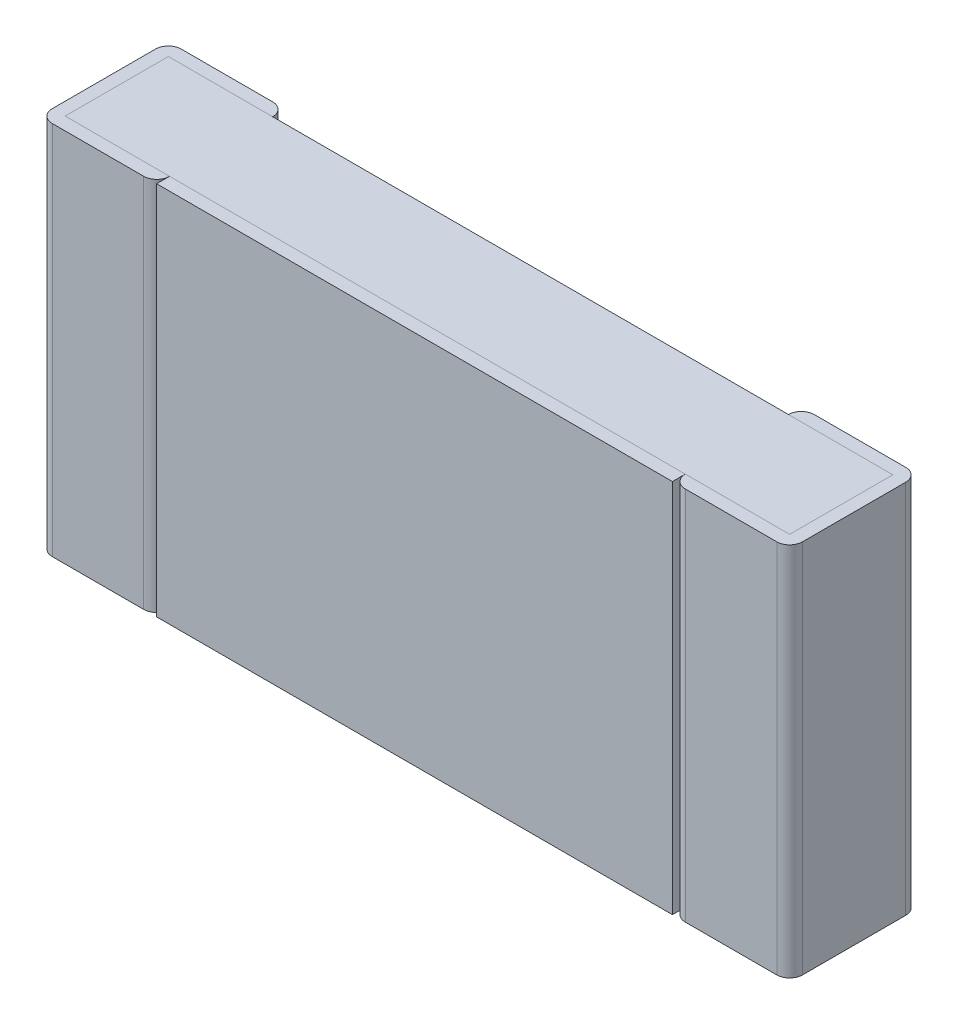
ISO-10303-21;
HEADER;
FILE_DESCRIPTION(('STEP AP214'),'2;1');
FILE_NAME('part.step','',(''),(''),'','','');
FILE_SCHEMA(('AUTOMOTIVE_DESIGN { 1 0 10303 214 1 1 1 1 }'));
ENDSEC;
DATA;
#1=APPLICATION_CONTEXT('core data for automotive mechanical design processes');
#2=APPLICATION_PROTOCOL_DEFINITION('international standard','automotive_design',2000,#1);
#3=PRODUCT_CONTEXT('',#1,'mechanical');
#4=PRODUCT('Part','Part','',(#3));
#5=PRODUCT_RELATED_PRODUCT_CATEGORY('part','',(#4));
#6=PRODUCT_DEFINITION_FORMATION('','',#4);
#7=PRODUCT_DEFINITION_CONTEXT('part definition',#1,'design');
#8=PRODUCT_DEFINITION('design','',#6,#7);
#9=PRODUCT_DEFINITION_SHAPE('','',#8);
#10=(LENGTH_UNIT() NAMED_UNIT(*) SI_UNIT(.MILLI.,.METRE.));
#11=(NAMED_UNIT(*) PLANE_ANGLE_UNIT() SI_UNIT($,.RADIAN.));
#12=(NAMED_UNIT(*) SI_UNIT($,.STERADIAN.) SOLID_ANGLE_UNIT());
#13=UNCERTAINTY_MEASURE_WITH_UNIT(LENGTH_MEASURE(1.E-05),#10,'distance_accuracy_value','');
#14=(GEOMETRIC_REPRESENTATION_CONTEXT(3) GLOBAL_UNCERTAINTY_ASSIGNED_CONTEXT((#13)) GLOBAL_UNIT_ASSIGNED_CONTEXT((#10,
#11,#12)) REPRESENTATION_CONTEXT('',''));
#15=CARTESIAN_POINT('',(0.,0.,0.));
#16=DIRECTION('',(0.,0.,1.));
#17=DIRECTION('',(1.,0.,0.));
#18=AXIS2_PLACEMENT_3D('',#15,#16,#17);
#19=CARTESIAN_POINT('',(-1.1,-0.8,0.55));
#20=DIRECTION('',(0.,0.,1.));
#21=DIRECTION('',(1.,0.,0.));
#22=AXIS2_PLACEMENT_3D('',#19,#20,#21);
#23=PLANE('',#22);
#24=DIRECTION('',(0.,1.,0.));
#25=VECTOR('',#24,1.);
#26=CARTESIAN_POINT('',(-1.1,-0.8,0.55));
#27=LINE('',#26,#25);
#28=CARTESIAN_POINT('',(-1.1,-0.8,0.55));
#29=VERTEX_POINT('',#28);
#30=CARTESIAN_POINT('',(-1.1,0.8,0.55));
#31=VERTEX_POINT('',#30);
#32=EDGE_CURVE('E253',#29,#31,#27,.T.);
#33=ORIENTED_EDGE('',*,*,#32,.F.);
#34=DIRECTION('',(1.,0.,0.));
#35=VECTOR('',#34,1.);
#36=CARTESIAN_POINT('',(-1.1,-0.8,0.55));
#37=LINE('',#36,#35);
#38=CARTESIAN_POINT('',(1.1,-0.8,0.55));
#39=VERTEX_POINT('',#38);
#40=EDGE_CURVE('E347',#29,#39,#37,.T.);
#41=ORIENTED_EDGE('',*,*,#40,.T.);
#42=DIRECTION('',(0.,1.,0.));
#43=VECTOR('',#42,1.);
#44=CARTESIAN_POINT('',(1.1,-0.8,0.55));
#45=LINE('',#44,#43);
#46=CARTESIAN_POINT('',(1.1,0.8,0.55));
#47=VERTEX_POINT('',#46);
#48=EDGE_CURVE('E11',#39,#47,#45,.T.);
#49=ORIENTED_EDGE('',*,*,#48,.T.);
#50=DIRECTION('',(1.,0.,0.));
#51=VECTOR('',#50,1.);
#52=CARTESIAN_POINT('',(-1.1,0.8,0.55));
#53=LINE('',#52,#51);
#54=EDGE_CURVE('E267',#31,#47,#53,.T.);
#55=ORIENTED_EDGE('',*,*,#54,.F.);
#56=EDGE_LOOP('',(#33,#41,#49,#55));
#57=FACE_BOUND('',#56,.T.);
#58=ADVANCED_FACE('F17',(#57),#23,.T.);
#59=CARTESIAN_POINT('',(1.1,-0.8,0.495));
#60=DIRECTION('',(1.,0.,0.));
#61=DIRECTION('',(0.,1.,0.));
#62=AXIS2_PLACEMENT_3D('',#59,#60,#61);
#63=PLANE('',#62);
#64=DIRECTION('',(0.,0.,1.));
#65=VECTOR('',#64,1.);
#66=CARTESIAN_POINT('',(1.1,-0.8,0.495));
#67=LINE('',#66,#65);
#68=CARTESIAN_POINT('',(1.1,-0.8,0.495));
#69=VERTEX_POINT('',#68);
#70=EDGE_CURVE('E392',#69,#39,#67,.T.);
#71=ORIENTED_EDGE('',*,*,#70,.F.);
#72=DIRECTION('',(0.,1.,0.));
#73=VECTOR('',#72,1.);
#74=CARTESIAN_POINT('',(1.1,-0.8,0.495));
#75=LINE('',#74,#73);
#76=CARTESIAN_POINT('',(1.1,0.8,0.495));
#77=VERTEX_POINT('',#76);
#78=EDGE_CURVE('E28',#69,#77,#75,.T.);
#79=ORIENTED_EDGE('',*,*,#78,.T.);
#80=DIRECTION('',(0.,0.,1.));
#81=VECTOR('',#80,1.);
#82=CARTESIAN_POINT('',(1.1,0.8,0.495));
#83=LINE('',#82,#81);
#84=EDGE_CURVE('E262',#77,#47,#83,.T.);
#85=ORIENTED_EDGE('',*,*,#84,.T.);
#86=ORIENTED_EDGE('',*,*,#48,.F.);
#87=EDGE_LOOP('',(#71,#79,#85,#86));
#88=FACE_BOUND('',#87,.T.);
#89=ADVANCED_FACE('F517',(#88),#63,.T.);
#90=CARTESIAN_POINT('',(1.155,-0.8,0.495));
#91=DIRECTION('',(0.,1.,0.));
#92=DIRECTION('',(-1.,0.,0.));
#93=AXIS2_PLACEMENT_3D('',#90,#91,#92);
#94=CYLINDRICAL_SURFACE('',#93,0.055);
#95=CARTESIAN_POINT('',(1.155,-0.8,0.495));
#96=DIRECTION('',(0.,1.,0.));
#97=DIRECTION('',(0.,0.,1.));
#98=AXIS2_PLACEMENT_3D('',#95,#96,#97);
#99=CIRCLE('',#98,0.055);
#100=CARTESIAN_POINT('',(1.155,-0.8,0.55));
#101=VERTEX_POINT('',#100);
#102=EDGE_CURVE('E339',#69,#101,#99,.T.);
#103=ORIENTED_EDGE('',*,*,#102,.T.);
#104=DIRECTION('',(0.,1.,0.));
#105=VECTOR('',#104,1.);
#106=CARTESIAN_POINT('',(1.155,-0.8,0.55));
#107=LINE('',#106,#105);
#108=CARTESIAN_POINT('',(1.155,0.8,0.55));
#109=VERTEX_POINT('',#108);
#110=EDGE_CURVE('E452',#101,#109,#107,.T.);
#111=ORIENTED_EDGE('',*,*,#110,.T.);
#112=CARTESIAN_POINT('',(1.155,0.8,0.495));
#113=DIRECTION('',(0.,1.,0.));
#114=DIRECTION('',(0.,0.,1.));
#115=AXIS2_PLACEMENT_3D('',#112,#113,#114);
#116=CIRCLE('',#115,0.055);
#117=EDGE_CURVE('E313',#77,#109,#116,.T.);
#118=ORIENTED_EDGE('',*,*,#117,.F.);
#119=ORIENTED_EDGE('',*,*,#78,.F.);
#120=EDGE_LOOP('',(#103,#111,#118,#119));
#121=FACE_BOUND('',#120,.T.);
#122=ADVANCED_FACE('F530',(#121),#94,.T.);
#123=CARTESIAN_POINT('',(1.1,-0.8,0.55));
#124=DIRECTION('',(0.,0.,1.));
#125=DIRECTION('',(1.,0.,0.));
#126=AXIS2_PLACEMENT_3D('',#123,#124,#125);
#127=PLANE('',#126);
#128=DIRECTION('',(1.,0.,0.));
#129=VECTOR('',#128,1.);
#130=CARTESIAN_POINT('',(1.1,0.8,0.55));
#131=LINE('',#130,#129);
#132=CARTESIAN_POINT('',(1.545,0.8,0.55));
#133=VERTEX_POINT('',#132);
#134=EDGE_CURVE('E320',#109,#133,#131,.T.);
#135=ORIENTED_EDGE('',*,*,#134,.F.);
#136=ORIENTED_EDGE('',*,*,#110,.F.);
#137=DIRECTION('',(1.,0.,0.));
#138=VECTOR('',#137,1.);
#139=CARTESIAN_POINT('',(1.1,-0.8,0.55));
#140=LINE('',#139,#138);
#141=CARTESIAN_POINT('',(1.545,-0.8,0.55));
#142=VERTEX_POINT('',#141);
#143=EDGE_CURVE('E21',#101,#142,#140,.T.);
#144=ORIENTED_EDGE('',*,*,#143,.T.);
#145=DIRECTION('',(0.,1.,0.));
#146=VECTOR('',#145,1.);
#147=CARTESIAN_POINT('',(1.545,-0.8,0.55));
#148=LINE('',#147,#146);
#149=EDGE_CURVE('E286',#142,#133,#148,.T.);
#150=ORIENTED_EDGE('',*,*,#149,.T.);
#151=EDGE_LOOP('',(#135,#136,#144,#150));
#152=FACE_BOUND('',#151,.T.);
#153=ADVANCED_FACE('F712',(#152),#127,.T.);
#154=CARTESIAN_POINT('',(1.545,-0.8,0.495));
#155=DIRECTION('',(0.,1.,0.));
#156=DIRECTION('',(1.,0.,0.));
#157=AXIS2_PLACEMENT_3D('',#154,#155,#156);
#158=CYLINDRICAL_SURFACE('',#157,0.055);
#159=DIRECTION('',(0.,1.,0.));
#160=VECTOR('',#159,1.);
#161=CARTESIAN_POINT('',(1.6,-0.8,0.495));
#162=LINE('',#161,#160);
#163=CARTESIAN_POINT('',(1.6,-0.8,0.495));
#164=VERTEX_POINT('',#163);
#165=CARTESIAN_POINT('',(1.6,0.8,0.495));
#166=VERTEX_POINT('',#165);
#167=EDGE_CURVE('E283',#164,#166,#162,.T.);
#168=ORIENTED_EDGE('',*,*,#167,.T.);
#169=CARTESIAN_POINT('',(1.545,0.8,0.495));
#170=DIRECTION('',(0.,-1.,0.));
#171=DIRECTION('',(0.,0.,1.));
#172=AXIS2_PLACEMENT_3D('',#169,#170,#171);
#173=CIRCLE('',#172,0.055);
#174=EDGE_CURVE('E328',#166,#133,#173,.T.);
#175=ORIENTED_EDGE('',*,*,#174,.T.);
#176=ORIENTED_EDGE('',*,*,#149,.F.);
#177=CARTESIAN_POINT('',(1.545,-0.8,0.495));
#178=DIRECTION('',(0.,-1.,0.));
#179=DIRECTION('',(0.,0.,1.));
#180=AXIS2_PLACEMENT_3D('',#177,#178,#179);
#181=CIRCLE('',#180,0.055);
#182=EDGE_CURVE('E353',#164,#142,#181,.T.);
#183=ORIENTED_EDGE('',*,*,#182,.F.);
#184=EDGE_LOOP('',(#168,#175,#176,#183));
#185=FACE_BOUND('',#184,.T.);
#186=ADVANCED_FACE('F707',(#185),#158,.T.);
#187=CARTESIAN_POINT('',(1.6,-0.8,0.));
#188=DIRECTION('',(1.,0.,0.));
#189=DIRECTION('',(0.,1.,0.));
#190=AXIS2_PLACEMENT_3D('',#187,#188,#189);
#191=PLANE('',#190);
#192=DIRECTION('',(0.,0.,1.));
#193=VECTOR('',#192,1.);
#194=CARTESIAN_POINT('',(1.6,-0.8,0.));
#195=LINE('',#194,#193);
#196=CARTESIAN_POINT('',(1.6,-0.8,0.055));
#197=VERTEX_POINT('',#196);
#198=EDGE_CURVE('E357',#197,#164,#195,.T.);
#199=ORIENTED_EDGE('',*,*,#198,.F.);
#200=DIRECTION('',(0.,1.,0.));
#201=VECTOR('',#200,1.);
#202=CARTESIAN_POINT('',(1.6,-0.8,0.055));
#203=LINE('',#202,#201);
#204=CARTESIAN_POINT('',(1.6,0.8,0.055));
#205=VERTEX_POINT('',#204);
#206=EDGE_CURVE('E287',#197,#205,#203,.T.);
#207=ORIENTED_EDGE('',*,*,#206,.T.);
#208=DIRECTION('',(0.,0.,1.));
#209=VECTOR('',#208,1.);
#210=CARTESIAN_POINT('',(1.6,0.8,0.));
#211=LINE('',#210,#209);
#212=EDGE_CURVE('E247',#205,#166,#211,.T.);
#213=ORIENTED_EDGE('',*,*,#212,.T.);
#214=ORIENTED_EDGE('',*,*,#167,.F.);
#215=EDGE_LOOP('',(#199,#207,#213,#214));
#216=FACE_BOUND('',#215,.T.);
#217=ADVANCED_FACE('F711',(#216),#191,.T.);
#218=CARTESIAN_POINT('',(1.545,-0.8,0.055));
#219=DIRECTION('',(0.,1.,0.));
#220=DIRECTION('',(1.,0.,0.));
#221=AXIS2_PLACEMENT_3D('',#218,#219,#220);
#222=CYLINDRICAL_SURFACE('',#221,0.055);
#223=CARTESIAN_POINT('',(1.545,-0.8,0.055));
#224=DIRECTION('',(0.,1.,0.));
#225=DIRECTION('',(0.,0.,1.));
#226=AXIS2_PLACEMENT_3D('',#223,#224,#225);
#227=CIRCLE('',#226,0.055);
#228=CARTESIAN_POINT('',(1.545,-0.8,0.));
#229=VERTEX_POINT('',#228);
#230=EDGE_CURVE('E368',#197,#229,#227,.T.);
#231=ORIENTED_EDGE('',*,*,#230,.T.);
#232=DIRECTION('',(0.,1.,0.));
#233=VECTOR('',#232,1.);
#234=CARTESIAN_POINT('',(1.545,-0.8,0.));
#235=LINE('',#234,#233);
#236=CARTESIAN_POINT('',(1.545,0.8,0.));
#237=VERTEX_POINT('',#236);
#238=EDGE_CURVE('E261',#229,#237,#235,.T.);
#239=ORIENTED_EDGE('',*,*,#238,.T.);
#240=CARTESIAN_POINT('',(1.545,0.8,0.055));
#241=DIRECTION('',(0.,1.,0.));
#242=DIRECTION('',(0.,0.,1.));
#243=AXIS2_PLACEMENT_3D('',#240,#241,#242);
#244=CIRCLE('',#243,0.055);
#245=EDGE_CURVE('E263',#205,#237,#244,.T.);
#246=ORIENTED_EDGE('',*,*,#245,.F.);
#247=ORIENTED_EDGE('',*,*,#206,.F.);
#248=EDGE_LOOP('',(#231,#239,#246,#247));
#249=FACE_BOUND('',#248,.T.);
#250=ADVANCED_FACE('F464',(#249),#222,.T.);
#251=CARTESIAN_POINT('',(1.1,-0.8,0.));
#252=DIRECTION('',(0.,0.,1.));
#253=DIRECTION('',(1.,0.,0.));
#254=AXIS2_PLACEMENT_3D('',#251,#252,#253);
#255=PLANE('',#254);
#256=ORIENTED_EDGE('',*,*,#238,.F.);
#257=DIRECTION('',(1.,0.,0.));
#258=VECTOR('',#257,1.);
#259=CARTESIAN_POINT('',(1.1,-0.8,0.));
#260=LINE('',#259,#258);
#261=CARTESIAN_POINT('',(1.155,-0.8,0.));
#262=VERTEX_POINT('',#261);
#263=EDGE_CURVE('E396',#262,#229,#260,.T.);
#264=ORIENTED_EDGE('',*,*,#263,.F.);
#265=DIRECTION('',(0.,1.,0.));
#266=VECTOR('',#265,1.);
#267=CARTESIAN_POINT('',(1.155,-0.8,0.));
#268=LINE('',#267,#266);
#269=CARTESIAN_POINT('',(1.155,0.8,0.));
#270=VERTEX_POINT('',#269);
#271=EDGE_CURVE('E258',#262,#270,#268,.T.);
#272=ORIENTED_EDGE('',*,*,#271,.T.);
#273=DIRECTION('',(1.,0.,0.));
#274=VECTOR('',#273,1.);
#275=CARTESIAN_POINT('',(1.1,0.8,0.));
#276=LINE('',#275,#274);
#277=EDGE_CURVE('E252',#270,#237,#276,.T.);
#278=ORIENTED_EDGE('',*,*,#277,.T.);
#279=EDGE_LOOP('',(#256,#264,#272,#278));
#280=FACE_BOUND('',#279,.T.);
#281=ADVANCED_FACE('F470',(#280),#255,.F.);
#282=CARTESIAN_POINT('',(1.155,-0.8,0.055));
#283=DIRECTION('',(0.,1.,0.));
#284=DIRECTION('',(-1.,0.,0.));
#285=AXIS2_PLACEMENT_3D('',#282,#283,#284);
#286=CYLINDRICAL_SURFACE('',#285,0.055);
#287=DIRECTION('',(0.,1.,0.));
#288=VECTOR('',#287,1.);
#289=CARTESIAN_POINT('',(1.1,-0.8,0.055));
#290=LINE('',#289,#288);
#291=CARTESIAN_POINT('',(1.1,-0.8,0.055));
#292=VERTEX_POINT('',#291);
#293=CARTESIAN_POINT('',(1.1,0.8,0.055));
#294=VERTEX_POINT('',#293);
#295=EDGE_CURVE('E375',#292,#294,#290,.T.);
#296=ORIENTED_EDGE('',*,*,#295,.T.);
#297=CARTESIAN_POINT('',(1.155,0.8,0.055));
#298=DIRECTION('',(0.,-1.,0.));
#299=DIRECTION('',(0.,0.,1.));
#300=AXIS2_PLACEMENT_3D('',#297,#298,#299);
#301=CIRCLE('',#300,0.055);
#302=EDGE_CURVE('E299',#294,#270,#301,.T.);
#303=ORIENTED_EDGE('',*,*,#302,.T.);
#304=ORIENTED_EDGE('',*,*,#271,.F.);
#305=CARTESIAN_POINT('',(1.155,-0.8,0.055));
#306=DIRECTION('',(0.,-1.,0.));
#307=DIRECTION('',(0.,0.,1.));
#308=AXIS2_PLACEMENT_3D('',#305,#306,#307);
#309=CIRCLE('',#308,0.055);
#310=EDGE_CURVE('E343',#292,#262,#309,.T.);
#311=ORIENTED_EDGE('',*,*,#310,.F.);
#312=EDGE_LOOP('',(#296,#303,#304,#311));
#313=FACE_BOUND('',#312,.T.);
#314=ADVANCED_FACE('F471',(#313),#286,.T.);
#315=CARTESIAN_POINT('',(-1.1,0.8,0.495));
#316=DIRECTION('',(0.,1.,0.));
#317=DIRECTION('',(1.,0.,0.));
#318=AXIS2_PLACEMENT_3D('',#315,#316,#317);
#319=PLANE('',#318);
#320=DIRECTION('',(1.,0.,0.));
#321=VECTOR('',#320,1.);
#322=CARTESIAN_POINT('',(-1.1,0.8,0.495));
#323=LINE('',#322,#321);
#324=CARTESIAN_POINT('',(-1.1,0.8,0.495));
#325=VERTEX_POINT('',#324);
#326=EDGE_CURVE('E236',#325,#77,#323,.T.);
#327=ORIENTED_EDGE('',*,*,#326,.F.);
#328=DIRECTION('',(0.,0.,1.));
#329=VECTOR('',#328,1.);
#330=CARTESIAN_POINT('',(-1.1,0.8,0.495));
#331=LINE('',#330,#329);
#332=EDGE_CURVE('E249',#325,#31,#331,.T.);
#333=ORIENTED_EDGE('',*,*,#332,.T.);
#334=ORIENTED_EDGE('',*,*,#54,.T.);
#335=ORIENTED_EDGE('',*,*,#84,.F.);
#336=EDGE_LOOP('',(#327,#333,#334,#335));
#337=FACE_BOUND('',#336,.T.);
#338=ADVANCED_FACE('F539',(#337),#319,.T.);
#339=CARTESIAN_POINT('',(1.1,0.8,0.));
#340=DIRECTION('',(0.,1.,0.));
#341=DIRECTION('',(1.,0.,0.));
#342=AXIS2_PLACEMENT_3D('',#339,#340,#341);
#343=PLANE('',#342);
#344=ORIENTED_EDGE('',*,*,#277,.F.);
#345=ORIENTED_EDGE('',*,*,#302,.F.);
#346=DIRECTION('',(1.,0.,0.));
#347=VECTOR('',#346,1.);
#348=CARTESIAN_POINT('',(-1.545,0.8,0.055));
#349=LINE('',#348,#347);
#350=CARTESIAN_POINT('',(1.545,0.8,0.055));
#351=VERTEX_POINT('',#350);
#352=EDGE_CURVE('E229',#294,#351,#349,.T.);
#353=ORIENTED_EDGE('',*,*,#352,.T.);
#354=DIRECTION('',(0.,0.,1.));
#355=VECTOR('',#354,1.);
#356=CARTESIAN_POINT('',(1.545,0.8,0.055));
#357=LINE('',#356,#355);
#358=CARTESIAN_POINT('',(1.545,0.8,0.495));
#359=VERTEX_POINT('',#358);
#360=EDGE_CURVE('E221',#351,#359,#357,.T.);
#361=ORIENTED_EDGE('',*,*,#360,.T.);
#362=DIRECTION('',(1.,0.,0.));
#363=VECTOR('',#362,1.);
#364=CARTESIAN_POINT('',(-1.545,0.8,0.495));
#365=LINE('',#364,#363);
#366=EDGE_CURVE('E226',#77,#359,#365,.T.);
#367=ORIENTED_EDGE('',*,*,#366,.F.);
#368=ORIENTED_EDGE('',*,*,#117,.T.);
#369=ORIENTED_EDGE('',*,*,#134,.T.);
#370=ORIENTED_EDGE('',*,*,#174,.F.);
#371=ORIENTED_EDGE('',*,*,#212,.F.);
#372=ORIENTED_EDGE('',*,*,#245,.T.);
#373=EDGE_LOOP('',(#344,#345,#353,#361,#367,#368,#369,#370,#371,#372));
#374=FACE_BOUND('',#373,.T.);
#375=ADVANCED_FACE('F224',(#374),#343,.T.);
#376=CARTESIAN_POINT('',(-1.1,-0.8,0.495));
#377=DIRECTION('',(1.,0.,0.));
#378=DIRECTION('',(0.,1.,0.));
#379=AXIS2_PLACEMENT_3D('',#376,#377,#378);
#380=PLANE('',#379);
#381=ORIENTED_EDGE('',*,*,#32,.T.);
#382=ORIENTED_EDGE('',*,*,#332,.F.);
#383=DIRECTION('',(0.,1.,0.));
#384=VECTOR('',#383,1.);
#385=CARTESIAN_POINT('',(-1.1,-0.8,0.495));
#386=LINE('',#385,#384);
#387=CARTESIAN_POINT('',(-1.1,-0.8,0.495));
#388=VERTEX_POINT('',#387);
#389=EDGE_CURVE('E332',#388,#325,#386,.T.);
#390=ORIENTED_EDGE('',*,*,#389,.F.);
#391=DIRECTION('',(0.,0.,1.));
#392=VECTOR('',#391,1.);
#393=CARTESIAN_POINT('',(-1.1,-0.8,0.495));
#394=LINE('',#393,#392);
#395=EDGE_CURVE('E344',#388,#29,#394,.T.);
#396=ORIENTED_EDGE('',*,*,#395,.T.);
#397=EDGE_LOOP('',(#381,#382,#390,#396));
#398=FACE_BOUND('',#397,.T.);
#399=ADVANCED_FACE('F555',(#398),#380,.F.);
#400=CARTESIAN_POINT('',(-1.1,-0.8,0.495));
#401=DIRECTION('',(0.,1.,0.));
#402=DIRECTION('',(1.,0.,0.));
#403=AXIS2_PLACEMENT_3D('',#400,#401,#402);
#404=PLANE('',#403);
#405=ORIENTED_EDGE('',*,*,#70,.T.);
#406=ORIENTED_EDGE('',*,*,#40,.F.);
#407=ORIENTED_EDGE('',*,*,#395,.F.);
#408=DIRECTION('',(1.,0.,0.));
#409=VECTOR('',#408,1.);
#410=CARTESIAN_POINT('',(-1.1,-0.8,0.495));
#411=LINE('',#410,#409);
#412=EDGE_CURVE('E386',#388,#69,#411,.T.);
#413=ORIENTED_EDGE('',*,*,#412,.T.);
#414=EDGE_LOOP('',(#405,#406,#407,#413));
#415=FACE_BOUND('',#414,.T.);
#416=ADVANCED_FACE('F561',(#415),#404,.F.);
#417=CARTESIAN_POINT('',(1.1,-0.8,0.));
#418=DIRECTION('',(0.,1.,0.));
#419=DIRECTION('',(1.,0.,0.));
#420=AXIS2_PLACEMENT_3D('',#417,#418,#419);
#421=PLANE('',#420);
#422=ORIENTED_EDGE('',*,*,#230,.F.);
#423=ORIENTED_EDGE('',*,*,#198,.T.);
#424=ORIENTED_EDGE('',*,*,#182,.T.);
#425=ORIENTED_EDGE('',*,*,#143,.F.);
#426=ORIENTED_EDGE('',*,*,#102,.F.);
#427=DIRECTION('',(1.,0.,0.));
#428=VECTOR('',#427,1.);
#429=CARTESIAN_POINT('',(-1.545,-0.8,0.495));
#430=LINE('',#429,#428);
#431=CARTESIAN_POINT('',(1.545,-0.8,0.495));
#432=VERTEX_POINT('',#431);
#433=EDGE_CURVE('E389',#69,#432,#430,.T.);
#434=ORIENTED_EDGE('',*,*,#433,.T.);
#435=DIRECTION('',(0.,0.,1.));
#436=VECTOR('',#435,1.);
#437=CARTESIAN_POINT('',(1.545,-0.8,0.055));
#438=LINE('',#437,#436);
#439=CARTESIAN_POINT('',(1.545,-0.8,0.055));
#440=VERTEX_POINT('',#439);
#441=EDGE_CURVE('E291',#440,#432,#438,.T.);
#442=ORIENTED_EDGE('',*,*,#441,.F.);
#443=DIRECTION('',(1.,0.,0.));
#444=VECTOR('',#443,1.);
#445=CARTESIAN_POINT('',(-1.545,-0.8,0.055));
#446=LINE('',#445,#444);
#447=EDGE_CURVE('E288',#292,#440,#446,.T.);
#448=ORIENTED_EDGE('',*,*,#447,.F.);
#449=ORIENTED_EDGE('',*,*,#310,.T.);
#450=ORIENTED_EDGE('',*,*,#263,.T.);
#451=EDGE_LOOP('',(#422,#423,#424,#425,#426,#434,#442,#448,#449,#450));
#452=FACE_BOUND('',#451,.T.);
#453=ADVANCED_FACE('F573',(#452),#421,.F.);
#454=CARTESIAN_POINT('',(-1.545,-0.8,0.055));
#455=DIRECTION('',(0.,0.,1.));
#456=DIRECTION('',(1.,0.,0.));
#457=AXIS2_PLACEMENT_3D('',#454,#455,#456);
#458=PLANE('',#457);
#459=DIRECTION('',(1.,0.,0.));
#460=VECTOR('',#459,1.);
#461=CARTESIAN_POINT('',(-1.545,0.8,0.055));
#462=LINE('',#461,#460);
#463=CARTESIAN_POINT('',(-1.1,0.8,0.055));
#464=VERTEX_POINT('',#463);
#465=EDGE_CURVE('E310',#464,#294,#462,.T.);
#466=ORIENTED_EDGE('',*,*,#465,.T.);
#467=ORIENTED_EDGE('',*,*,#295,.F.);
#468=DIRECTION('',(1.,0.,0.));
#469=VECTOR('',#468,1.);
#470=CARTESIAN_POINT('',(-1.545,-0.8,0.055));
#471=LINE('',#470,#469);
#472=CARTESIAN_POINT('',(-1.1,-0.8,0.055));
#473=VERTEX_POINT('',#472);
#474=EDGE_CURVE('E105',#473,#292,#471,.T.);
#475=ORIENTED_EDGE('',*,*,#474,.F.);
#476=DIRECTION('',(0.,1.,0.));
#477=VECTOR('',#476,1.);
#478=CARTESIAN_POINT('',(-1.1,-0.8,0.055));
#479=LINE('',#478,#477);
#480=EDGE_CURVE('E349',#473,#464,#479,.T.);
#481=ORIENTED_EDGE('',*,*,#480,.T.);
#482=EDGE_LOOP('',(#466,#467,#475,#481));
#483=FACE_BOUND('',#482,.T.);
#484=ADVANCED_FACE('F582',(#483),#458,.F.);
#485=CARTESIAN_POINT('',(-1.545,0.8,0.055));
#486=DIRECTION('',(0.,1.,0.));
#487=DIRECTION('',(1.,0.,0.));
#488=AXIS2_PLACEMENT_3D('',#485,#486,#487);
#489=PLANE('',#488);
#490=DIRECTION('',(1.,0.,0.));
#491=VECTOR('',#490,1.);
#492=CARTESIAN_POINT('',(-1.545,0.8,0.055));
#493=LINE('',#492,#491);
#494=CARTESIAN_POINT('',(-1.545,0.8,0.055));
#495=VERTEX_POINT('',#494);
#496=EDGE_CURVE('E838',#495,#464,#493,.T.);
#497=ORIENTED_EDGE('',*,*,#496,.F.);
#498=DIRECTION('',(0.,0.,1.));
#499=VECTOR('',#498,1.);
#500=CARTESIAN_POINT('',(-1.545,0.8,0.055));
#501=LINE('',#500,#499);
#502=CARTESIAN_POINT('',(-1.545,0.8,0.495));
#503=VERTEX_POINT('',#502);
#504=EDGE_CURVE('E271',#495,#503,#501,.T.);
#505=ORIENTED_EDGE('',*,*,#504,.T.);
#506=DIRECTION('',(1.,0.,0.));
#507=VECTOR('',#506,1.);
#508=CARTESIAN_POINT('',(-1.545,0.8,0.495));
#509=LINE('',#508,#507);
#510=EDGE_CURVE('E268',#503,#325,#509,.T.);
#511=ORIENTED_EDGE('',*,*,#510,.T.);
#512=ORIENTED_EDGE('',*,*,#326,.T.);
#513=ORIENTED_EDGE('',*,*,#366,.T.);
#514=ORIENTED_EDGE('',*,*,#360,.F.);
#515=ORIENTED_EDGE('',*,*,#352,.F.);
#516=ORIENTED_EDGE('',*,*,#465,.F.);
#517=EDGE_LOOP('',(#497,#505,#511,#512,#513,#514,#515,#516));
#518=FACE_BOUND('',#517,.T.);
#519=ADVANCED_FACE('F233',(#518),#489,.T.);
#520=CARTESIAN_POINT('',(-1.6,-0.8,0.55));
#521=DIRECTION('',(0.,0.,1.));
#522=DIRECTION('',(1.,0.,0.));
#523=AXIS2_PLACEMENT_3D('',#520,#521,#522);
#524=PLANE('',#523);
#525=DIRECTION('',(1.,0.,0.));
#526=VECTOR('',#525,1.);
#527=CARTESIAN_POINT('',(-1.6,0.8,0.55));
#528=LINE('',#527,#526);
#529=CARTESIAN_POINT('',(-1.545,0.8,0.55));
#530=VERTEX_POINT('',#529);
#531=CARTESIAN_POINT('',(-1.155,0.8,0.55));
#532=VERTEX_POINT('',#531);
#533=EDGE_CURVE('E337',#530,#532,#528,.T.);
#534=ORIENTED_EDGE('',*,*,#533,.F.);
#535=DIRECTION('',(0.,1.,0.));
#536=VECTOR('',#535,1.);
#537=CARTESIAN_POINT('',(-1.545,-0.8,0.55));
#538=LINE('',#537,#536);
#539=CARTESIAN_POINT('',(-1.545,-0.8,0.55));
#540=VERTEX_POINT('',#539);
#541=EDGE_CURVE('E361',#540,#530,#538,.T.);
#542=ORIENTED_EDGE('',*,*,#541,.F.);
#543=DIRECTION('',(1.,0.,0.));
#544=VECTOR('',#543,1.);
#545=CARTESIAN_POINT('',(-1.6,-0.8,0.55));
#546=LINE('',#545,#544);
#547=CARTESIAN_POINT('',(-1.155,-0.8,0.55));
#548=VERTEX_POINT('',#547);
#549=EDGE_CURVE('E276',#540,#548,#546,.T.);
#550=ORIENTED_EDGE('',*,*,#549,.T.);
#551=DIRECTION('',(0.,1.,0.));
#552=VECTOR('',#551,1.);
#553=CARTESIAN_POINT('',(-1.155,-0.8,0.55));
#554=LINE('',#553,#552);
#555=EDGE_CURVE('E243',#548,#532,#554,.T.);
#556=ORIENTED_EDGE('',*,*,#555,.T.);
#557=EDGE_LOOP('',(#534,#542,#550,#556));
#558=FACE_BOUND('',#557,.T.);
#559=ADVANCED_FACE('F598',(#558),#524,.T.);
#560=CARTESIAN_POINT('',(-1.155,-0.8,0.495));
#561=DIRECTION('',(0.,1.,0.));
#562=DIRECTION('',(1.,0.,0.));
#563=AXIS2_PLACEMENT_3D('',#560,#561,#562);
#564=CYLINDRICAL_SURFACE('',#563,0.055);
#565=ORIENTED_EDGE('',*,*,#389,.T.);
#566=CARTESIAN_POINT('',(-1.155,0.8,0.495));
#567=DIRECTION('',(0.,-1.,0.));
#568=DIRECTION('',(0.,0.,1.));
#569=AXIS2_PLACEMENT_3D('',#566,#567,#568);
#570=CIRCLE('',#569,0.055);
#571=EDGE_CURVE('E272',#325,#532,#570,.T.);
#572=ORIENTED_EDGE('',*,*,#571,.T.);
#573=ORIENTED_EDGE('',*,*,#555,.F.);
#574=CARTESIAN_POINT('',(-1.155,-0.8,0.495));
#575=DIRECTION('',(0.,-1.,0.));
#576=DIRECTION('',(0.,0.,1.));
#577=AXIS2_PLACEMENT_3D('',#574,#575,#576);
#578=CIRCLE('',#577,0.055);
#579=EDGE_CURVE('E300',#388,#548,#578,.T.);
#580=ORIENTED_EDGE('',*,*,#579,.F.);
#581=EDGE_LOOP('',(#565,#572,#573,#580));
#582=FACE_BOUND('',#581,.T.);
#583=ADVANCED_FACE('F612',(#582),#564,.T.);
#584=CARTESIAN_POINT('',(-1.545,-0.8,0.055));
#585=DIRECTION('',(0.,1.,0.));
#586=DIRECTION('',(1.,0.,0.));
#587=AXIS2_PLACEMENT_3D('',#584,#585,#586);
#588=PLANE('',#587);
#589=ORIENTED_EDGE('',*,*,#474,.T.);
#590=ORIENTED_EDGE('',*,*,#447,.T.);
#591=ORIENTED_EDGE('',*,*,#441,.T.);
#592=ORIENTED_EDGE('',*,*,#433,.F.);
#593=ORIENTED_EDGE('',*,*,#412,.F.);
#594=DIRECTION('',(1.,0.,0.));
#595=VECTOR('',#594,1.);
#596=CARTESIAN_POINT('',(-1.545,-0.8,0.495));
#597=LINE('',#596,#595);
#598=CARTESIAN_POINT('',(-1.545,-0.8,0.495));
#599=VERTEX_POINT('',#598);
#600=EDGE_CURVE('E304',#599,#388,#597,.T.);
#601=ORIENTED_EDGE('',*,*,#600,.F.);
#602=DIRECTION('',(0.,0.,1.));
#603=VECTOR('',#602,1.);
#604=CARTESIAN_POINT('',(-1.545,-0.8,0.055));
#605=LINE('',#604,#603);
#606=CARTESIAN_POINT('',(-1.545,-0.8,0.055));
#607=VERTEX_POINT('',#606);
#608=EDGE_CURVE('E305',#607,#599,#605,.T.);
#609=ORIENTED_EDGE('',*,*,#608,.F.);
#610=DIRECTION('',(1.,0.,0.));
#611=VECTOR('',#610,1.);
#612=CARTESIAN_POINT('',(-1.545,-0.8,0.055));
#613=LINE('',#612,#611);
#614=EDGE_CURVE('E281',#607,#473,#613,.T.);
#615=ORIENTED_EDGE('',*,*,#614,.T.);
#616=EDGE_LOOP('',(#589,#590,#591,#592,#593,#601,#609,#615));
#617=FACE_BOUND('',#616,.T.);
#618=ADVANCED_FACE('F606',(#617),#588,.F.);
#619=CARTESIAN_POINT('',(-1.155,-0.8,0.055));
#620=DIRECTION('',(0.,1.,0.));
#621=DIRECTION('',(1.,0.,0.));
#622=AXIS2_PLACEMENT_3D('',#619,#620,#621);
#623=CYLINDRICAL_SURFACE('',#622,0.055);
#624=CARTESIAN_POINT('',(-1.155,-0.8,0.055));
#625=DIRECTION('',(0.,1.,0.));
#626=DIRECTION('',(0.,0.,1.));
#627=AXIS2_PLACEMENT_3D('',#624,#625,#626);
#628=CIRCLE('',#627,0.055);
#629=CARTESIAN_POINT('',(-1.155,-0.8,0.));
#630=VERTEX_POINT('',#629);
#631=EDGE_CURVE('E277',#473,#630,#628,.T.);
#632=ORIENTED_EDGE('',*,*,#631,.T.);
#633=DIRECTION('',(0.,1.,0.));
#634=VECTOR('',#633,1.);
#635=CARTESIAN_POINT('',(-1.155,-0.8,0.));
#636=LINE('',#635,#634);
#637=CARTESIAN_POINT('',(-1.155,0.8,0.));
#638=VERTEX_POINT('',#637);
#639=EDGE_CURVE('E351',#630,#638,#636,.T.);
#640=ORIENTED_EDGE('',*,*,#639,.T.);
#641=CARTESIAN_POINT('',(-1.155,0.8,0.055));
#642=DIRECTION('',(0.,1.,0.));
#643=DIRECTION('',(0.,0.,1.));
#644=AXIS2_PLACEMENT_3D('',#641,#642,#643);
#645=CIRCLE('',#644,0.055);
#646=EDGE_CURVE('E835',#464,#638,#645,.T.);
#647=ORIENTED_EDGE('',*,*,#646,.F.);
#648=ORIENTED_EDGE('',*,*,#480,.F.);
#649=EDGE_LOOP('',(#632,#640,#647,#648));
#650=FACE_BOUND('',#649,.T.);
#651=ADVANCED_FACE('F611',(#650),#623,.T.);
#652=CARTESIAN_POINT('',(-1.6,-0.8,0.));
#653=DIRECTION('',(0.,0.,1.));
#654=DIRECTION('',(1.,0.,0.));
#655=AXIS2_PLACEMENT_3D('',#652,#653,#654);
#656=PLANE('',#655);
#657=ORIENTED_EDGE('',*,*,#639,.F.);
#658=DIRECTION('',(1.,0.,0.));
#659=VECTOR('',#658,1.);
#660=CARTESIAN_POINT('',(-1.6,-0.8,0.));
#661=LINE('',#660,#659);
#662=CARTESIAN_POINT('',(-1.545,-0.8,0.));
#663=VERTEX_POINT('',#662);
#664=EDGE_CURVE('E256',#663,#630,#661,.T.);
#665=ORIENTED_EDGE('',*,*,#664,.F.);
#666=DIRECTION('',(0.,1.,0.));
#667=VECTOR('',#666,1.);
#668=CARTESIAN_POINT('',(-1.545,-0.8,0.));
#669=LINE('',#668,#667);
#670=CARTESIAN_POINT('',(-1.545,0.8,0.));
#671=VERTEX_POINT('',#670);
#672=EDGE_CURVE('E407',#663,#671,#669,.T.);
#673=ORIENTED_EDGE('',*,*,#672,.T.);
#674=DIRECTION('',(1.,0.,0.));
#675=VECTOR('',#674,1.);
#676=CARTESIAN_POINT('',(-1.6,0.8,0.));
#677=LINE('',#676,#675);
#678=EDGE_CURVE('E334',#671,#638,#677,.T.);
#679=ORIENTED_EDGE('',*,*,#678,.T.);
#680=EDGE_LOOP('',(#657,#665,#673,#679));
#681=FACE_BOUND('',#680,.T.);
#682=ADVANCED_FACE('F632',(#681),#656,.F.);
#683=CARTESIAN_POINT('',(-1.6,0.8,0.));
#684=DIRECTION('',(0.,1.,0.));
#685=DIRECTION('',(1.,0.,0.));
#686=AXIS2_PLACEMENT_3D('',#683,#684,#685);
#687=PLANE('',#686);
#688=ORIENTED_EDGE('',*,*,#678,.F.);
#689=CARTESIAN_POINT('',(-1.545,0.8,0.055));
#690=DIRECTION('',(0.,-1.,0.));
#691=DIRECTION('',(0.,0.,1.));
#692=AXIS2_PLACEMENT_3D('',#689,#690,#691);
#693=CIRCLE('',#692,0.055);
#694=CARTESIAN_POINT('',(-1.6,0.8,0.055));
#695=VERTEX_POINT('',#694);
#696=EDGE_CURVE('E410',#695,#671,#693,.T.);
#697=ORIENTED_EDGE('',*,*,#696,.F.);
#698=DIRECTION('',(0.,0.,1.));
#699=VECTOR('',#698,1.);
#700=CARTESIAN_POINT('',(-1.6,0.8,0.));
#701=LINE('',#700,#699);
#702=CARTESIAN_POINT('',(-1.6,0.8,0.495));
#703=VERTEX_POINT('',#702);
#704=EDGE_CURVE('E430',#695,#703,#701,.T.);
#705=ORIENTED_EDGE('',*,*,#704,.T.);
#706=CARTESIAN_POINT('',(-1.545,0.8,0.495));
#707=DIRECTION('',(0.,1.,0.));
#708=DIRECTION('',(0.,0.,1.));
#709=AXIS2_PLACEMENT_3D('',#706,#707,#708);
#710=CIRCLE('',#709,0.055);
#711=EDGE_CURVE('E338',#703,#530,#710,.T.);
#712=ORIENTED_EDGE('',*,*,#711,.T.);
#713=ORIENTED_EDGE('',*,*,#533,.T.);
#714=ORIENTED_EDGE('',*,*,#571,.F.);
#715=ORIENTED_EDGE('',*,*,#510,.F.);
#716=ORIENTED_EDGE('',*,*,#504,.F.);
#717=ORIENTED_EDGE('',*,*,#496,.T.);
#718=ORIENTED_EDGE('',*,*,#646,.T.);
#719=EDGE_LOOP('',(#688,#697,#705,#712,#713,#714,#715,#716,#717,#718));
#720=FACE_BOUND('',#719,.T.);
#721=ADVANCED_FACE('F643',(#720),#687,.T.);
#722=CARTESIAN_POINT('',(-1.545,-0.8,0.495));
#723=DIRECTION('',(0.,1.,0.));
#724=DIRECTION('',(-1.,0.,0.));
#725=AXIS2_PLACEMENT_3D('',#722,#723,#724);
#726=CYLINDRICAL_SURFACE('',#725,0.055);
#727=CARTESIAN_POINT('',(-1.545,-0.8,0.495));
#728=DIRECTION('',(0.,1.,0.));
#729=DIRECTION('',(0.,0.,1.));
#730=AXIS2_PLACEMENT_3D('',#727,#728,#729);
#731=CIRCLE('',#730,0.055);
#732=CARTESIAN_POINT('',(-1.6,-0.8,0.495));
#733=VERTEX_POINT('',#732);
#734=EDGE_CURVE('E257',#733,#540,#731,.T.);
#735=ORIENTED_EDGE('',*,*,#734,.T.);
#736=ORIENTED_EDGE('',*,*,#541,.T.);
#737=ORIENTED_EDGE('',*,*,#711,.F.);
#738=DIRECTION('',(0.,1.,0.));
#739=VECTOR('',#738,1.);
#740=CARTESIAN_POINT('',(-1.6,-0.8,0.495));
#741=LINE('',#740,#739);
#742=EDGE_CURVE('E436',#733,#703,#741,.T.);
#743=ORIENTED_EDGE('',*,*,#742,.F.);
#744=EDGE_LOOP('',(#735,#736,#737,#743));
#745=FACE_BOUND('',#744,.T.);
#746=ADVANCED_FACE('F653',(#745),#726,.T.);
#747=CARTESIAN_POINT('',(-1.545,-0.8,0.055));
#748=DIRECTION('',(0.,1.,0.));
#749=DIRECTION('',(-1.,0.,0.));
#750=AXIS2_PLACEMENT_3D('',#747,#748,#749);
#751=CYLINDRICAL_SURFACE('',#750,0.055);
#752=DIRECTION('',(0.,1.,0.));
#753=VECTOR('',#752,1.);
#754=CARTESIAN_POINT('',(-1.6,-0.8,0.055));
#755=LINE('',#754,#753);
#756=CARTESIAN_POINT('',(-1.6,-0.8,0.055));
#757=VERTEX_POINT('',#756);
#758=EDGE_CURVE('E406',#757,#695,#755,.T.);
#759=ORIENTED_EDGE('',*,*,#758,.T.);
#760=ORIENTED_EDGE('',*,*,#696,.T.);
#761=ORIENTED_EDGE('',*,*,#672,.F.);
#762=CARTESIAN_POINT('',(-1.545,-0.8,0.055));
#763=DIRECTION('',(0.,-1.,0.));
#764=DIRECTION('',(0.,0.,1.));
#765=AXIS2_PLACEMENT_3D('',#762,#763,#764);
#766=CIRCLE('',#765,0.055);
#767=EDGE_CURVE('E119',#757,#663,#766,.T.);
#768=ORIENTED_EDGE('',*,*,#767,.F.);
#769=EDGE_LOOP('',(#759,#760,#761,#768));
#770=FACE_BOUND('',#769,.T.);
#771=ADVANCED_FACE('F663',(#770),#751,.T.);
#772=CARTESIAN_POINT('',(-1.6,-0.8,0.));
#773=DIRECTION('',(0.,1.,0.));
#774=DIRECTION('',(1.,0.,0.));
#775=AXIS2_PLACEMENT_3D('',#772,#773,#774);
#776=PLANE('',#775);
#777=ORIENTED_EDGE('',*,*,#631,.F.);
#778=ORIENTED_EDGE('',*,*,#614,.F.);
#779=ORIENTED_EDGE('',*,*,#608,.T.);
#780=ORIENTED_EDGE('',*,*,#600,.T.);
#781=ORIENTED_EDGE('',*,*,#579,.T.);
#782=ORIENTED_EDGE('',*,*,#549,.F.);
#783=ORIENTED_EDGE('',*,*,#734,.F.);
#784=DIRECTION('',(0.,0.,1.));
#785=VECTOR('',#784,1.);
#786=CARTESIAN_POINT('',(-1.6,-0.8,0.));
#787=LINE('',#786,#785);
#788=EDGE_CURVE('E282',#757,#733,#787,.T.);
#789=ORIENTED_EDGE('',*,*,#788,.F.);
#790=ORIENTED_EDGE('',*,*,#767,.T.);
#791=ORIENTED_EDGE('',*,*,#664,.T.);
#792=EDGE_LOOP('',(#777,#778,#779,#780,#781,#782,#783,#789,#790,#791));
#793=FACE_BOUND('',#792,.T.);
#794=ADVANCED_FACE('F19',(#793),#776,.F.);
#795=CARTESIAN_POINT('',(-1.6,-0.8,0.));
#796=DIRECTION('',(1.,0.,0.));
#797=DIRECTION('',(0.,1.,0.));
#798=AXIS2_PLACEMENT_3D('',#795,#796,#797);
#799=PLANE('',#798);
#800=ORIENTED_EDGE('',*,*,#742,.T.);
#801=ORIENTED_EDGE('',*,*,#704,.F.);
#802=ORIENTED_EDGE('',*,*,#758,.F.);
#803=ORIENTED_EDGE('',*,*,#788,.T.);
#804=EDGE_LOOP('',(#800,#801,#802,#803));
#805=FACE_BOUND('',#804,.T.);
#806=ADVANCED_FACE('F683',(#805),#799,.F.);
#807=CLOSED_SHELL('',(#58,#89,#122,#153,#186,#217,#250,#281,#314,#338,#375,#399,#416,#453,#484,
#519,#559,#583,#618,#651,#682,#721,#746,#771,#794,#806));
#808=MANIFOLD_SOLID_BREP('B1',#807);
#809=ADVANCED_BREP_SHAPE_REPRESENTATION('',(#18,#808),#14);
#810=SHAPE_DEFINITION_REPRESENTATION(#9,#809);
ENDSEC;
END-ISO-10303-21;
